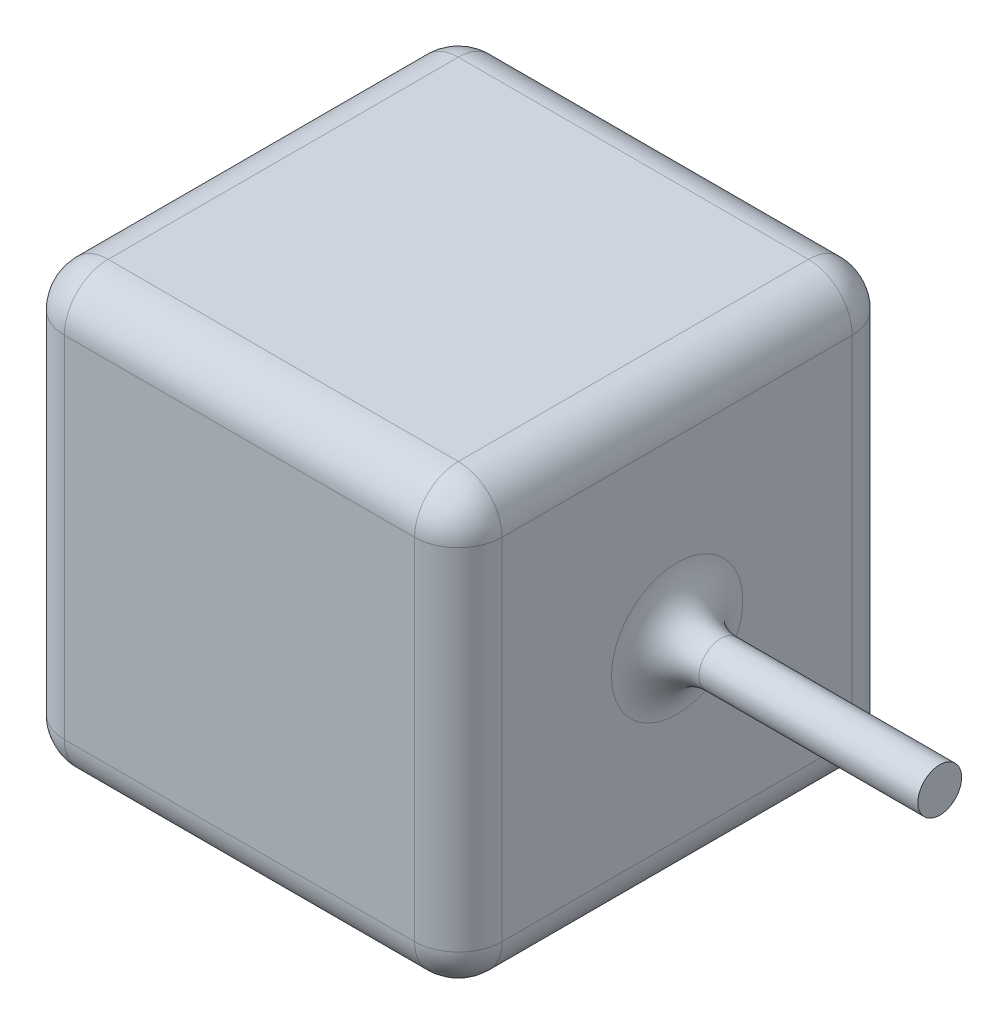
ISO-10303-21;
HEADER;
FILE_DESCRIPTION(('STEP AP214'),'2;1');
FILE_NAME('part.step','',(''),(''),'','','');
FILE_SCHEMA(('AUTOMOTIVE_DESIGN { 1 0 10303 214 1 1 1 1 }'));
ENDSEC;
DATA;
#1=APPLICATION_CONTEXT('core data for automotive mechanical design processes');
#2=APPLICATION_PROTOCOL_DEFINITION('international standard','automotive_design',2000,#1);
#3=PRODUCT_CONTEXT('',#1,'mechanical');
#4=PRODUCT('Part','Part','',(#3));
#5=PRODUCT_RELATED_PRODUCT_CATEGORY('part','',(#4));
#6=PRODUCT_DEFINITION_FORMATION('','',#4);
#7=PRODUCT_DEFINITION_CONTEXT('part definition',#1,'design');
#8=PRODUCT_DEFINITION('design','',#6,#7);
#9=PRODUCT_DEFINITION_SHAPE('','',#8);
#10=(LENGTH_UNIT() NAMED_UNIT(*) SI_UNIT(.MILLI.,.METRE.));
#11=(NAMED_UNIT(*) PLANE_ANGLE_UNIT() SI_UNIT($,.RADIAN.));
#12=(NAMED_UNIT(*) SI_UNIT($,.STERADIAN.) SOLID_ANGLE_UNIT());
#13=UNCERTAINTY_MEASURE_WITH_UNIT(LENGTH_MEASURE(1.E-05),#10,'distance_accuracy_value','');
#14=(GEOMETRIC_REPRESENTATION_CONTEXT(3) GLOBAL_UNCERTAINTY_ASSIGNED_CONTEXT((#13)) GLOBAL_UNIT_ASSIGNED_CONTEXT((#10,
#11,#12)) REPRESENTATION_CONTEXT('',''));
#15=CARTESIAN_POINT('',(0.,0.,0.));
#16=DIRECTION('',(0.,0.,1.));
#17=DIRECTION('',(1.,0.,0.));
#18=AXIS2_PLACEMENT_3D('',#15,#16,#17);
#19=CARTESIAN_POINT('',(0.,100.,0.));
#20=DIRECTION('',(1.,0.,0.));
#21=DIRECTION('',(0.,0.,-1.));
#22=AXIS2_PLACEMENT_3D('',#19,#20,#21);
#23=PLANE('',#22);
#24=DIRECTION('',(0.,0.,1.));
#25=VECTOR('',#24,1.);
#26=CARTESIAN_POINT('',(0.,90.,0.));
#27=LINE('',#26,#25);
#28=CARTESIAN_POINT('',(0.,90.,-10.));
#29=VERTEX_POINT('',#28);
#30=CARTESIAN_POINT('',(0.,90.,-90.));
#31=VERTEX_POINT('',#30);
#32=EDGE_CURVE('E127',#29,#31,#27,.F.);
#33=ORIENTED_EDGE('',*,*,#32,.T.);
#34=DIRECTION('',(0.,-1.,0.));
#35=VECTOR('',#34,1.);
#36=CARTESIAN_POINT('',(0.,100.,-90.));
#37=LINE('',#36,#35);
#38=CARTESIAN_POINT('',(0.,9.99999999999999,-90.));
#39=VERTEX_POINT('',#38);
#40=EDGE_CURVE('E165',#31,#39,#37,.T.);
#41=ORIENTED_EDGE('',*,*,#40,.T.);
#42=DIRECTION('',(0.,0.,1.));
#43=VECTOR('',#42,1.);
#44=CARTESIAN_POINT('',(0.,9.99999999999999,0.));
#45=LINE('',#44,#43);
#46=CARTESIAN_POINT('',(0.,9.99999999999999,-10.));
#47=VERTEX_POINT('',#46);
#48=EDGE_CURVE('E130',#39,#47,#45,.T.);
#49=ORIENTED_EDGE('',*,*,#48,.T.);
#50=DIRECTION('',(0.,-1.,0.));
#51=VECTOR('',#50,1.);
#52=CARTESIAN_POINT('',(0.,100.,-10.));
#53=LINE('',#52,#51);
#54=EDGE_CURVE('E123',#47,#29,#53,.F.);
#55=ORIENTED_EDGE('',*,*,#54,.T.);
#56=EDGE_LOOP('',(#33,#41,#49,#55));
#57=FACE_BOUND('',#56,.T.);
#58=ADVANCED_FACE('F35',(#57),#23,.F.);
#59=CARTESIAN_POINT('',(0.,100.,0.));
#60=DIRECTION('',(0.,0.,-1.));
#61=DIRECTION('',(-1.,0.,0.));
#62=AXIS2_PLACEMENT_3D('',#59,#60,#61);
#63=PLANE('',#62);
#64=DIRECTION('',(0.,-1.,0.));
#65=VECTOR('',#64,1.);
#66=CARTESIAN_POINT('',(10.,100.,0.));
#67=LINE('',#66,#65);
#68=CARTESIAN_POINT('',(10.,90.,0.));
#69=VERTEX_POINT('',#68);
#70=CARTESIAN_POINT('',(10.,9.99999999999999,0.));
#71=VERTEX_POINT('',#70);
#72=EDGE_CURVE('E141',#69,#71,#67,.T.);
#73=ORIENTED_EDGE('',*,*,#72,.T.);
#74=DIRECTION('',(1.,0.,0.));
#75=VECTOR('',#74,1.);
#76=CARTESIAN_POINT('',(100.,9.99999999999999,0.));
#77=LINE('',#76,#75);
#78=CARTESIAN_POINT('',(90.,9.99999999999999,0.));
#79=VERTEX_POINT('',#78);
#80=EDGE_CURVE('E205',#71,#79,#77,.T.);
#81=ORIENTED_EDGE('',*,*,#80,.T.);
#82=DIRECTION('',(0.,-1.,0.));
#83=VECTOR('',#82,1.);
#84=CARTESIAN_POINT('',(90.,100.,0.));
#85=LINE('',#84,#83);
#86=CARTESIAN_POINT('',(90.,90.,0.));
#87=VERTEX_POINT('',#86);
#88=EDGE_CURVE('E202',#79,#87,#85,.F.);
#89=ORIENTED_EDGE('',*,*,#88,.T.);
#90=DIRECTION('',(1.,0.,0.));
#91=VECTOR('',#90,1.);
#92=CARTESIAN_POINT('',(0.,90.,0.));
#93=LINE('',#92,#91);
#94=EDGE_CURVE('E200',#87,#69,#93,.F.);
#95=ORIENTED_EDGE('',*,*,#94,.T.);
#96=EDGE_LOOP('',(#73,#81,#89,#95));
#97=FACE_BOUND('',#96,.T.);
#98=ADVANCED_FACE('F288',(#97),#63,.F.);
#99=CARTESIAN_POINT('',(100.,100.,0.));
#100=DIRECTION('',(-1.,0.,0.));
#101=DIRECTION('',(0.,0.,1.));
#102=AXIS2_PLACEMENT_3D('',#99,#100,#101);
#103=PLANE('',#102);
#104=CARTESIAN_POINT('',(100.,50.,-50.));
#105=DIRECTION('',(-1.,0.,0.));
#106=DIRECTION('',(0.,0.,1.));
#107=AXIS2_PLACEMENT_3D('',#104,#105,#106);
#108=CIRCLE('',#107,15.);
#109=CARTESIAN_POINT('',(100.,50.,-35.));
#110=VERTEX_POINT('',#109);
#111=EDGE_CURVE('E194',#110,#110,#108,.T.);
#112=ORIENTED_EDGE('',*,*,#111,.T.);
#113=EDGE_LOOP('',(#112));
#114=FACE_BOUND('',#113,.T.);
#115=DIRECTION('',(0.,0.,-1.));
#116=VECTOR('',#115,1.);
#117=CARTESIAN_POINT('',(100.,9.99999999999999,-100.));
#118=LINE('',#117,#116);
#119=CARTESIAN_POINT('',(100.,9.99999999999999,-10.));
#120=VERTEX_POINT('',#119);
#121=CARTESIAN_POINT('',(100.,9.99999999999999,-90.));
#122=VERTEX_POINT('',#121);
#123=EDGE_CURVE('E189',#120,#122,#118,.T.);
#124=ORIENTED_EDGE('',*,*,#123,.T.);
#125=DIRECTION('',(0.,-1.,0.));
#126=VECTOR('',#125,1.);
#127=CARTESIAN_POINT('',(100.,100.,-90.));
#128=LINE('',#127,#126);
#129=CARTESIAN_POINT('',(100.,90.,-90.));
#130=VERTEX_POINT('',#129);
#131=EDGE_CURVE('E191',#122,#130,#128,.F.);
#132=ORIENTED_EDGE('',*,*,#131,.T.);
#133=DIRECTION('',(0.,0.,-1.));
#134=VECTOR('',#133,1.);
#135=CARTESIAN_POINT('',(100.,90.,0.));
#136=LINE('',#135,#134);
#137=CARTESIAN_POINT('',(100.,90.,-10.));
#138=VERTEX_POINT('',#137);
#139=EDGE_CURVE('E185',#130,#138,#136,.F.);
#140=ORIENTED_EDGE('',*,*,#139,.T.);
#141=DIRECTION('',(0.,-1.,0.));
#142=VECTOR('',#141,1.);
#143=CARTESIAN_POINT('',(100.,100.,-10.));
#144=LINE('',#143,#142);
#145=EDGE_CURVE('E187',#138,#120,#144,.T.);
#146=ORIENTED_EDGE('',*,*,#145,.T.);
#147=EDGE_LOOP('',(#124,#132,#140,#146));
#148=FACE_BOUND('',#147,.T.);
#149=ADVANCED_FACE('F300',(#114,#148),#103,.F.);
#150=CARTESIAN_POINT('',(0.,100.,-100.));
#151=DIRECTION('',(0.,0.,1.));
#152=DIRECTION('',(1.,0.,0.));
#153=AXIS2_PLACEMENT_3D('',#150,#151,#152);
#154=PLANE('',#153);
#155=DIRECTION('',(-1.,0.,0.));
#156=VECTOR('',#155,1.);
#157=CARTESIAN_POINT('',(0.,9.99999999999999,-100.));
#158=LINE('',#157,#156);
#159=CARTESIAN_POINT('',(90.,9.99999999999999,-100.));
#160=VERTEX_POINT('',#159);
#161=CARTESIAN_POINT('',(10.,9.99999999999999,-100.));
#162=VERTEX_POINT('',#161);
#163=EDGE_CURVE('E171',#160,#162,#158,.T.);
#164=ORIENTED_EDGE('',*,*,#163,.T.);
#165=DIRECTION('',(0.,-1.,0.));
#166=VECTOR('',#165,1.);
#167=CARTESIAN_POINT('',(10.,100.,-100.));
#168=LINE('',#167,#166);
#169=CARTESIAN_POINT('',(10.,90.,-100.));
#170=VERTEX_POINT('',#169);
#171=EDGE_CURVE('E173',#162,#170,#168,.F.);
#172=ORIENTED_EDGE('',*,*,#171,.T.);
#173=DIRECTION('',(-1.,0.,0.));
#174=VECTOR('',#173,1.);
#175=CARTESIAN_POINT('',(0.,90.,-100.));
#176=LINE('',#175,#174);
#177=CARTESIAN_POINT('',(90.,90.,-100.));
#178=VERTEX_POINT('',#177);
#179=EDGE_CURVE('E167',#170,#178,#176,.F.);
#180=ORIENTED_EDGE('',*,*,#179,.T.);
#181=DIRECTION('',(0.,-1.,0.));
#182=VECTOR('',#181,1.);
#183=CARTESIAN_POINT('',(90.,100.,-100.));
#184=LINE('',#183,#182);
#185=EDGE_CURVE('E169',#178,#160,#184,.T.);
#186=ORIENTED_EDGE('',*,*,#185,.T.);
#187=EDGE_LOOP('',(#164,#172,#180,#186));
#188=FACE_BOUND('',#187,.T.);
#189=ADVANCED_FACE('F307',(#188),#154,.F.);
#190=CARTESIAN_POINT('',(0.,100.,0.));
#191=DIRECTION('',(0.,-1.,0.));
#192=DIRECTION('',(0.,0.,-1.));
#193=AXIS2_PLACEMENT_3D('',#190,#191,#192);
#194=PLANE('',#193);
#195=DIRECTION('',(0.,0.,-1.));
#196=VECTOR('',#195,1.);
#197=CARTESIAN_POINT('',(90.,100.,0.));
#198=LINE('',#197,#196);
#199=CARTESIAN_POINT('',(90.,100.,-10.));
#200=VERTEX_POINT('',#199);
#201=CARTESIAN_POINT('',(90.,100.,-90.));
#202=VERTEX_POINT('',#201);
#203=EDGE_CURVE('E44',#200,#202,#198,.T.);
#204=ORIENTED_EDGE('',*,*,#203,.T.);
#205=DIRECTION('',(-1.,0.,0.));
#206=VECTOR('',#205,1.);
#207=CARTESIAN_POINT('',(0.,100.,-90.));
#208=LINE('',#207,#206);
#209=CARTESIAN_POINT('',(10.,100.,-90.));
#210=VERTEX_POINT('',#209);
#211=EDGE_CURVE('E11',#202,#210,#208,.T.);
#212=ORIENTED_EDGE('',*,*,#211,.T.);
#213=DIRECTION('',(0.,0.,1.));
#214=VECTOR('',#213,1.);
#215=CARTESIAN_POINT('',(10.,100.,0.));
#216=LINE('',#215,#214);
#217=CARTESIAN_POINT('',(10.,100.,-10.));
#218=VERTEX_POINT('',#217);
#219=EDGE_CURVE('E207',#210,#218,#216,.T.);
#220=ORIENTED_EDGE('',*,*,#219,.T.);
#221=DIRECTION('',(1.,0.,0.));
#222=VECTOR('',#221,1.);
#223=CARTESIAN_POINT('',(0.,100.,-10.));
#224=LINE('',#223,#222);
#225=EDGE_CURVE('E55',#218,#200,#224,.T.);
#226=ORIENTED_EDGE('',*,*,#225,.T.);
#227=EDGE_LOOP('',(#204,#212,#220,#226));
#228=FACE_BOUND('',#227,.T.);
#229=ADVANCED_FACE('F284',(#228),#194,.F.);
#230=CARTESIAN_POINT('',(0.,0.,0.));
#231=DIRECTION('',(0.,-1.,0.));
#232=DIRECTION('',(0.,0.,-1.));
#233=AXIS2_PLACEMENT_3D('',#230,#231,#232);
#234=PLANE('',#233);
#235=DIRECTION('',(0.,0.,1.));
#236=VECTOR('',#235,1.);
#237=CARTESIAN_POINT('',(10.,0.,-100.));
#238=LINE('',#237,#236);
#239=CARTESIAN_POINT('',(10.,0.,-10.));
#240=VERTEX_POINT('',#239);
#241=CARTESIAN_POINT('',(10.,0.,-90.));
#242=VERTEX_POINT('',#241);
#243=EDGE_CURVE('E180',#240,#242,#238,.F.);
#244=ORIENTED_EDGE('',*,*,#243,.T.);
#245=DIRECTION('',(-1.,0.,0.));
#246=VECTOR('',#245,1.);
#247=CARTESIAN_POINT('',(100.,0.,-90.));
#248=LINE('',#247,#246);
#249=CARTESIAN_POINT('',(90.,0.,-90.));
#250=VERTEX_POINT('',#249);
#251=EDGE_CURVE('E182',#242,#250,#248,.F.);
#252=ORIENTED_EDGE('',*,*,#251,.T.);
#253=DIRECTION('',(0.,0.,-1.));
#254=VECTOR('',#253,1.);
#255=CARTESIAN_POINT('',(90.,0.,0.));
#256=LINE('',#255,#254);
#257=CARTESIAN_POINT('',(90.,0.,-10.));
#258=VERTEX_POINT('',#257);
#259=EDGE_CURVE('E178',#250,#258,#256,.F.);
#260=ORIENTED_EDGE('',*,*,#259,.T.);
#261=DIRECTION('',(1.,0.,0.));
#262=VECTOR('',#261,1.);
#263=CARTESIAN_POINT('',(0.,0.,-10.));
#264=LINE('',#263,#262);
#265=EDGE_CURVE('E176',#258,#240,#264,.F.);
#266=ORIENTED_EDGE('',*,*,#265,.T.);
#267=EDGE_LOOP('',(#244,#252,#260,#266));
#268=FACE_BOUND('',#267,.T.);
#269=ADVANCED_FACE('F328',(#268),#234,.T.);
#270=CARTESIAN_POINT('',(160.,50.,-50.));
#271=DIRECTION('',(-1.,0.,0.));
#272=DIRECTION('',(0.,0.,1.));
#273=AXIS2_PLACEMENT_3D('',#270,#271,#272);
#274=CYLINDRICAL_SURFACE('',#273,5.00000000000001);
#275=CARTESIAN_POINT('',(110.,50.,-50.));
#276=DIRECTION('',(-1.,0.,0.));
#277=DIRECTION('',(0.,0.,1.));
#278=AXIS2_PLACEMENT_3D('',#275,#276,#277);
#279=CIRCLE('',#278,5.00000000000001);
#280=CARTESIAN_POINT('',(110.,50.,-45.));
#281=VERTEX_POINT('',#280);
#282=EDGE_CURVE('E197',#281,#281,#279,.F.);
#283=ORIENTED_EDGE('',*,*,#282,.T.);
#284=EDGE_LOOP('',(#283));
#285=FACE_BOUND('',#284,.T.);
#286=CARTESIAN_POINT('',(160.,50.,-50.));
#287=DIRECTION('',(1.,0.,0.));
#288=DIRECTION('',(0.,0.,-1.));
#289=AXIS2_PLACEMENT_3D('',#286,#287,#288);
#290=CIRCLE('',#289,5.00000000000001);
#291=CARTESIAN_POINT('',(160.,50.,-55.));
#292=VERTEX_POINT('',#291);
#293=EDGE_CURVE('E159',#292,#292,#290,.T.);
#294=ORIENTED_EDGE('',*,*,#293,.F.);
#295=EDGE_LOOP('',(#294));
#296=FACE_BOUND('',#295,.T.);
#297=ADVANCED_FACE('F506',(#285,#296),#274,.T.);
#298=CARTESIAN_POINT('',(160.,50.,-50.));
#299=DIRECTION('',(1.,0.,0.));
#300=DIRECTION('',(0.,0.,-1.));
#301=AXIS2_PLACEMENT_3D('',#298,#299,#300);
#302=PLANE('',#301);
#303=ORIENTED_EDGE('',*,*,#293,.T.);
#304=EDGE_LOOP('',(#303));
#305=FACE_BOUND('',#304,.T.);
#306=ADVANCED_FACE('F498',(#305),#302,.T.);
#307=CARTESIAN_POINT('',(90.,100.,-10.));
#308=DIRECTION('',(0.,-1.,0.));
#309=DIRECTION('',(0.,0.,-1.));
#310=AXIS2_PLACEMENT_3D('',#307,#308,#309);
#311=CYLINDRICAL_SURFACE('',#310,10.);
#312=CARTESIAN_POINT('',(90.,90.,-10.));
#313=DIRECTION('',(0.,1.,0.));
#314=DIRECTION('',(0.,0.,1.));
#315=AXIS2_PLACEMENT_3D('',#312,#313,#314);
#316=CIRCLE('',#315,10.);
#317=EDGE_CURVE('E39',#87,#138,#316,.T.);
#318=ORIENTED_EDGE('',*,*,#317,.F.);
#319=ORIENTED_EDGE('',*,*,#88,.F.);
#320=CARTESIAN_POINT('',(90.,9.99999999999999,-10.));
#321=DIRECTION('',(0.,-1.,0.));
#322=DIRECTION('',(0.,0.,-1.));
#323=AXIS2_PLACEMENT_3D('',#320,#321,#322);
#324=CIRCLE('',#323,10.);
#325=EDGE_CURVE('E256',#120,#79,#324,.T.);
#326=ORIENTED_EDGE('',*,*,#325,.F.);
#327=ORIENTED_EDGE('',*,*,#145,.F.);
#328=EDGE_LOOP('',(#318,#319,#326,#327));
#329=FACE_BOUND('',#328,.T.);
#330=ADVANCED_FACE('F290',(#329),#311,.T.);
#331=CARTESIAN_POINT('',(90.,90.,-10.));
#332=DIRECTION('',(0.,0.,1.));
#333=DIRECTION('',(1.,0.,0.));
#334=AXIS2_PLACEMENT_3D('',#331,#332,#333);
#335=SPHERICAL_SURFACE('',#334,10.);
#336=CARTESIAN_POINT('',(90.,90.,-10.));
#337=DIRECTION('',(1.,0.,0.));
#338=DIRECTION('',(0.,0.,-1.));
#339=AXIS2_PLACEMENT_3D('',#336,#337,#338);
#340=CIRCLE('',#339,10.);
#341=EDGE_CURVE('E252',#87,#200,#340,.F.);
#342=ORIENTED_EDGE('',*,*,#341,.F.);
#343=ORIENTED_EDGE('',*,*,#317,.T.);
#344=CARTESIAN_POINT('',(90.,90.,-10.));
#345=DIRECTION('',(0.,0.,1.));
#346=DIRECTION('',(1.,0.,0.));
#347=AXIS2_PLACEMENT_3D('',#344,#345,#346);
#348=CIRCLE('',#347,10.);
#349=EDGE_CURVE('E254',#200,#138,#348,.F.);
#350=ORIENTED_EDGE('',*,*,#349,.F.);
#351=EDGE_LOOP('',(#342,#343,#350));
#352=FACE_BOUND('',#351,.T.);
#353=ADVANCED_FACE('F267',(#352),#335,.T.);
#354=CARTESIAN_POINT('',(90.,10.,-10.));
#355=DIRECTION('',(0.,0.,1.));
#356=DIRECTION('',(1.,0.,0.));
#357=AXIS2_PLACEMENT_3D('',#354,#355,#356);
#358=SPHERICAL_SURFACE('',#357,10.);
#359=CARTESIAN_POINT('',(90.,10.,-10.));
#360=DIRECTION('',(0.,0.,1.));
#361=DIRECTION('',(1.,0.,0.));
#362=AXIS2_PLACEMENT_3D('',#359,#360,#361);
#363=CIRCLE('',#362,10.);
#364=EDGE_CURVE('E246',#120,#258,#363,.F.);
#365=ORIENTED_EDGE('',*,*,#364,.F.);
#366=ORIENTED_EDGE('',*,*,#325,.T.);
#367=CARTESIAN_POINT('',(90.,9.99999999999999,-10.));
#368=DIRECTION('',(1.,0.,0.));
#369=DIRECTION('',(0.,0.,-1.));
#370=AXIS2_PLACEMENT_3D('',#367,#368,#369);
#371=CIRCLE('',#370,10.);
#372=EDGE_CURVE('E249',#258,#79,#371,.F.);
#373=ORIENTED_EDGE('',*,*,#372,.F.);
#374=EDGE_LOOP('',(#365,#366,#373));
#375=FACE_BOUND('',#374,.T.);
#376=ADVANCED_FACE('F292',(#375),#358,.T.);
#377=CARTESIAN_POINT('',(90.,90.,0.));
#378=DIRECTION('',(0.,0.,-1.));
#379=DIRECTION('',(-1.,0.,0.));
#380=AXIS2_PLACEMENT_3D('',#377,#378,#379);
#381=CYLINDRICAL_SURFACE('',#380,10.);
#382=ORIENTED_EDGE('',*,*,#349,.T.);
#383=ORIENTED_EDGE('',*,*,#139,.F.);
#384=CARTESIAN_POINT('',(90.,90.,-90.));
#385=DIRECTION('',(0.,0.,-1.));
#386=DIRECTION('',(-1.,0.,0.));
#387=AXIS2_PLACEMENT_3D('',#384,#385,#386);
#388=CIRCLE('',#387,10.);
#389=EDGE_CURVE('E241',#202,#130,#388,.T.);
#390=ORIENTED_EDGE('',*,*,#389,.F.);
#391=ORIENTED_EDGE('',*,*,#203,.F.);
#392=EDGE_LOOP('',(#382,#383,#390,#391));
#393=FACE_BOUND('',#392,.T.);
#394=ADVANCED_FACE('F274',(#393),#381,.T.);
#395=CARTESIAN_POINT('',(0.,90.,-10.));
#396=DIRECTION('',(1.,0.,0.));
#397=DIRECTION('',(0.,0.,-1.));
#398=AXIS2_PLACEMENT_3D('',#395,#396,#397);
#399=CYLINDRICAL_SURFACE('',#398,10.);
#400=ORIENTED_EDGE('',*,*,#341,.T.);
#401=ORIENTED_EDGE('',*,*,#225,.F.);
#402=CARTESIAN_POINT('',(10.,90.,-10.));
#403=DIRECTION('',(-1.,0.,0.));
#404=DIRECTION('',(0.,0.,1.));
#405=AXIS2_PLACEMENT_3D('',#402,#403,#404);
#406=CIRCLE('',#405,10.);
#407=EDGE_CURVE('E145',#69,#218,#406,.T.);
#408=ORIENTED_EDGE('',*,*,#407,.F.);
#409=ORIENTED_EDGE('',*,*,#94,.F.);
#410=EDGE_LOOP('',(#400,#401,#408,#409));
#411=FACE_BOUND('',#410,.T.);
#412=ADVANCED_FACE('F286',(#411),#399,.T.);
#413=CARTESIAN_POINT('',(10.,100.,-10.));
#414=DIRECTION('',(0.,-1.,0.));
#415=DIRECTION('',(0.,0.,-1.));
#416=AXIS2_PLACEMENT_3D('',#413,#414,#415);
#417=CYLINDRICAL_SURFACE('',#416,10.);
#418=CARTESIAN_POINT('',(10.,9.99999999999999,-10.));
#419=DIRECTION('',(0.,-1.,0.));
#420=DIRECTION('',(0.,0.,-1.));
#421=AXIS2_PLACEMENT_3D('',#418,#419,#420);
#422=CIRCLE('',#421,10.);
#423=EDGE_CURVE('E146',#71,#47,#422,.T.);
#424=ORIENTED_EDGE('',*,*,#423,.F.);
#425=ORIENTED_EDGE('',*,*,#72,.F.);
#426=CARTESIAN_POINT('',(10.,90.,-10.));
#427=DIRECTION('',(0.,1.,0.));
#428=DIRECTION('',(0.,0.,1.));
#429=AXIS2_PLACEMENT_3D('',#426,#427,#428);
#430=CIRCLE('',#429,10.);
#431=EDGE_CURVE('E137',#29,#69,#430,.T.);
#432=ORIENTED_EDGE('',*,*,#431,.F.);
#433=ORIENTED_EDGE('',*,*,#54,.F.);
#434=EDGE_LOOP('',(#424,#425,#432,#433));
#435=FACE_BOUND('',#434,.T.);
#436=ADVANCED_FACE('F139',(#435),#417,.T.);
#437=CARTESIAN_POINT('',(0.,9.99999999999999,-10.));
#438=DIRECTION('',(-1.,0.,0.));
#439=DIRECTION('',(0.,0.,1.));
#440=AXIS2_PLACEMENT_3D('',#437,#438,#439);
#441=CYLINDRICAL_SURFACE('',#440,10.);
#442=ORIENTED_EDGE('',*,*,#372,.T.);
#443=ORIENTED_EDGE('',*,*,#80,.F.);
#444=CARTESIAN_POINT('',(10.,10.,-10.));
#445=DIRECTION('',(-1.,0.,0.));
#446=DIRECTION('',(0.,0.,1.));
#447=AXIS2_PLACEMENT_3D('',#444,#445,#446);
#448=CIRCLE('',#447,10.);
#449=EDGE_CURVE('E237',#240,#71,#448,.T.);
#450=ORIENTED_EDGE('',*,*,#449,.F.);
#451=ORIENTED_EDGE('',*,*,#265,.F.);
#452=EDGE_LOOP('',(#442,#443,#450,#451));
#453=FACE_BOUND('',#452,.T.);
#454=ADVANCED_FACE('F326',(#453),#441,.T.);
#455=CARTESIAN_POINT('',(90.,9.99999999999999,0.));
#456=DIRECTION('',(0.,0.,1.));
#457=DIRECTION('',(1.,0.,0.));
#458=AXIS2_PLACEMENT_3D('',#455,#456,#457);
#459=CYLINDRICAL_SURFACE('',#458,10.);
#460=ORIENTED_EDGE('',*,*,#364,.T.);
#461=ORIENTED_EDGE('',*,*,#259,.F.);
#462=CARTESIAN_POINT('',(90.,9.99999999999999,-90.));
#463=DIRECTION('',(0.,0.,-1.));
#464=DIRECTION('',(-1.,0.,0.));
#465=AXIS2_PLACEMENT_3D('',#462,#463,#464);
#466=CIRCLE('',#465,10.);
#467=EDGE_CURVE('E234',#122,#250,#466,.T.);
#468=ORIENTED_EDGE('',*,*,#467,.F.);
#469=ORIENTED_EDGE('',*,*,#123,.F.);
#470=EDGE_LOOP('',(#460,#461,#468,#469));
#471=FACE_BOUND('',#470,.T.);
#472=ADVANCED_FACE('F297',(#471),#459,.T.);
#473=CARTESIAN_POINT('',(90.,100.,-90.));
#474=DIRECTION('',(0.,-1.,0.));
#475=DIRECTION('',(0.,0.,-1.));
#476=AXIS2_PLACEMENT_3D('',#473,#474,#475);
#477=CYLINDRICAL_SURFACE('',#476,10.);
#478=CARTESIAN_POINT('',(90.,90.,-90.));
#479=DIRECTION('',(0.,1.,0.));
#480=DIRECTION('',(0.,0.,1.));
#481=AXIS2_PLACEMENT_3D('',#478,#479,#480);
#482=CIRCLE('',#481,10.);
#483=EDGE_CURVE('E243',#130,#178,#482,.T.);
#484=ORIENTED_EDGE('',*,*,#483,.F.);
#485=ORIENTED_EDGE('',*,*,#131,.F.);
#486=CARTESIAN_POINT('',(90.,9.99999999999999,-90.));
#487=DIRECTION('',(0.,-1.,0.));
#488=DIRECTION('',(0.,0.,-1.));
#489=AXIS2_PLACEMENT_3D('',#486,#487,#488);
#490=CIRCLE('',#489,10.);
#491=EDGE_CURVE('E231',#160,#122,#490,.T.);
#492=ORIENTED_EDGE('',*,*,#491,.F.);
#493=ORIENTED_EDGE('',*,*,#185,.F.);
#494=EDGE_LOOP('',(#484,#485,#492,#493));
#495=FACE_BOUND('',#494,.T.);
#496=ADVANCED_FACE('F303',(#495),#477,.T.);
#497=CARTESIAN_POINT('',(90.,90.,-90.));
#498=DIRECTION('',(0.,0.,1.));
#499=DIRECTION('',(1.,0.,0.));
#500=AXIS2_PLACEMENT_3D('',#497,#498,#499);
#501=SPHERICAL_SURFACE('',#500,10.);
#502=ORIENTED_EDGE('',*,*,#389,.T.);
#503=ORIENTED_EDGE('',*,*,#483,.T.);
#504=CARTESIAN_POINT('',(90.,90.,-90.));
#505=DIRECTION('',(1.,0.,0.));
#506=DIRECTION('',(0.,0.,-1.));
#507=AXIS2_PLACEMENT_3D('',#504,#505,#506);
#508=CIRCLE('',#507,10.);
#509=EDGE_CURVE('E153',#202,#178,#508,.F.);
#510=ORIENTED_EDGE('',*,*,#509,.F.);
#511=EDGE_LOOP('',(#502,#503,#510));
#512=FACE_BOUND('',#511,.T.);
#513=ADVANCED_FACE('F279',(#512),#501,.T.);
#514=CARTESIAN_POINT('',(10.,90.,-10.));
#515=DIRECTION('',(0.,0.,1.));
#516=DIRECTION('',(1.,0.,0.));
#517=AXIS2_PLACEMENT_3D('',#514,#515,#516);
#518=SPHERICAL_SURFACE('',#517,10.);
#519=ORIENTED_EDGE('',*,*,#431,.T.);
#520=ORIENTED_EDGE('',*,*,#407,.T.);
#521=CARTESIAN_POINT('',(10.,90.,-10.));
#522=DIRECTION('',(0.,0.,1.));
#523=DIRECTION('',(1.,0.,0.));
#524=AXIS2_PLACEMENT_3D('',#521,#522,#523);
#525=CIRCLE('',#524,10.);
#526=EDGE_CURVE('E149',#29,#218,#525,.F.);
#527=ORIENTED_EDGE('',*,*,#526,.F.);
#528=EDGE_LOOP('',(#519,#520,#527));
#529=FACE_BOUND('',#528,.T.);
#530=ADVANCED_FACE('F150',(#529),#518,.T.);
#531=CARTESIAN_POINT('',(10.,10.,-10.));
#532=DIRECTION('',(0.,0.,1.));
#533=DIRECTION('',(1.,0.,0.));
#534=AXIS2_PLACEMENT_3D('',#531,#532,#533);
#535=SPHERICAL_SURFACE('',#534,10.);
#536=ORIENTED_EDGE('',*,*,#449,.T.);
#537=ORIENTED_EDGE('',*,*,#423,.T.);
#538=CARTESIAN_POINT('',(10.,9.99999999999999,-10.));
#539=DIRECTION('',(0.,0.,1.));
#540=DIRECTION('',(1.,0.,0.));
#541=AXIS2_PLACEMENT_3D('',#538,#539,#540);
#542=CIRCLE('',#541,10.);
#543=EDGE_CURVE('E154',#240,#47,#542,.F.);
#544=ORIENTED_EDGE('',*,*,#543,.F.);
#545=EDGE_LOOP('',(#536,#537,#544));
#546=FACE_BOUND('',#545,.T.);
#547=ADVANCED_FACE('F323',(#546),#535,.T.);
#548=CARTESIAN_POINT('',(90.,10.,-90.));
#549=DIRECTION('',(0.,0.,1.));
#550=DIRECTION('',(1.,0.,0.));
#551=AXIS2_PLACEMENT_3D('',#548,#549,#550);
#552=SPHERICAL_SURFACE('',#551,10.);
#553=ORIENTED_EDGE('',*,*,#491,.T.);
#554=ORIENTED_EDGE('',*,*,#467,.T.);
#555=CARTESIAN_POINT('',(90.,10.,-90.));
#556=DIRECTION('',(1.,0.,0.));
#557=DIRECTION('',(0.,0.,-1.));
#558=AXIS2_PLACEMENT_3D('',#555,#556,#557);
#559=CIRCLE('',#558,10.);
#560=EDGE_CURVE('E225',#160,#250,#559,.F.);
#561=ORIENTED_EDGE('',*,*,#560,.F.);
#562=EDGE_LOOP('',(#553,#554,#561));
#563=FACE_BOUND('',#562,.T.);
#564=ADVANCED_FACE('F333',(#563),#552,.T.);
#565=CARTESIAN_POINT('',(0.,90.,-90.));
#566=DIRECTION('',(-1.,0.,0.));
#567=DIRECTION('',(0.,0.,1.));
#568=AXIS2_PLACEMENT_3D('',#565,#566,#567);
#569=CYLINDRICAL_SURFACE('',#568,10.);
#570=ORIENTED_EDGE('',*,*,#509,.T.);
#571=ORIENTED_EDGE('',*,*,#179,.F.);
#572=CARTESIAN_POINT('',(10.,90.,-90.));
#573=DIRECTION('',(-1.,0.,0.));
#574=DIRECTION('',(0.,0.,1.));
#575=AXIS2_PLACEMENT_3D('',#572,#573,#574);
#576=CIRCLE('',#575,10.);
#577=EDGE_CURVE('E222',#210,#170,#576,.T.);
#578=ORIENTED_EDGE('',*,*,#577,.F.);
#579=ORIENTED_EDGE('',*,*,#211,.F.);
#580=EDGE_LOOP('',(#570,#571,#578,#579));
#581=FACE_BOUND('',#580,.T.);
#582=ADVANCED_FACE('F283',(#581),#569,.T.);
#583=CARTESIAN_POINT('',(10.,90.,0.));
#584=DIRECTION('',(0.,0.,1.));
#585=DIRECTION('',(1.,0.,0.));
#586=AXIS2_PLACEMENT_3D('',#583,#584,#585);
#587=CYLINDRICAL_SURFACE('',#586,10.);
#588=ORIENTED_EDGE('',*,*,#526,.T.);
#589=ORIENTED_EDGE('',*,*,#219,.F.);
#590=CARTESIAN_POINT('',(10.,90.,-90.));
#591=DIRECTION('',(0.,0.,-1.));
#592=DIRECTION('',(-1.,0.,0.));
#593=AXIS2_PLACEMENT_3D('',#590,#591,#592);
#594=CIRCLE('',#593,10.);
#595=EDGE_CURVE('E157',#31,#210,#594,.T.);
#596=ORIENTED_EDGE('',*,*,#595,.F.);
#597=ORIENTED_EDGE('',*,*,#32,.F.);
#598=EDGE_LOOP('',(#588,#589,#596,#597));
#599=FACE_BOUND('',#598,.T.);
#600=ADVANCED_FACE('F156',(#599),#587,.T.);
#601=CARTESIAN_POINT('',(10.,9.99999999999999,0.));
#602=DIRECTION('',(0.,0.,-1.));
#603=DIRECTION('',(-1.,0.,0.));
#604=AXIS2_PLACEMENT_3D('',#601,#602,#603);
#605=CYLINDRICAL_SURFACE('',#604,10.);
#606=ORIENTED_EDGE('',*,*,#543,.T.);
#607=ORIENTED_EDGE('',*,*,#48,.F.);
#608=CARTESIAN_POINT('',(10.,10.,-90.));
#609=DIRECTION('',(0.,0.,-1.));
#610=DIRECTION('',(-1.,0.,0.));
#611=AXIS2_PLACEMENT_3D('',#608,#609,#610);
#612=CIRCLE('',#611,10.);
#613=EDGE_CURVE('E218',#242,#39,#612,.T.);
#614=ORIENTED_EDGE('',*,*,#613,.F.);
#615=ORIENTED_EDGE('',*,*,#243,.F.);
#616=EDGE_LOOP('',(#606,#607,#614,#615));
#617=FACE_BOUND('',#616,.T.);
#618=ADVANCED_FACE('F320',(#617),#605,.T.);
#619=CARTESIAN_POINT('',(0.,9.99999999999999,-90.));
#620=DIRECTION('',(1.,0.,0.));
#621=DIRECTION('',(0.,0.,-1.));
#622=AXIS2_PLACEMENT_3D('',#619,#620,#621);
#623=CYLINDRICAL_SURFACE('',#622,10.);
#624=ORIENTED_EDGE('',*,*,#560,.T.);
#625=ORIENTED_EDGE('',*,*,#251,.F.);
#626=CARTESIAN_POINT('',(10.,9.99999999999999,-90.));
#627=DIRECTION('',(-1.,0.,0.));
#628=DIRECTION('',(0.,0.,1.));
#629=AXIS2_PLACEMENT_3D('',#626,#627,#628);
#630=CIRCLE('',#629,10.);
#631=EDGE_CURVE('E215',#162,#242,#630,.T.);
#632=ORIENTED_EDGE('',*,*,#631,.F.);
#633=ORIENTED_EDGE('',*,*,#163,.F.);
#634=EDGE_LOOP('',(#624,#625,#632,#633));
#635=FACE_BOUND('',#634,.T.);
#636=ADVANCED_FACE('F331',(#635),#623,.T.);
#637=CARTESIAN_POINT('',(10.,90.,-90.));
#638=DIRECTION('',(0.,0.,1.));
#639=DIRECTION('',(1.,0.,0.));
#640=AXIS2_PLACEMENT_3D('',#637,#638,#639);
#641=SPHERICAL_SURFACE('',#640,10.);
#642=ORIENTED_EDGE('',*,*,#595,.T.);
#643=ORIENTED_EDGE('',*,*,#577,.T.);
#644=CARTESIAN_POINT('',(10.,90.,-90.));
#645=DIRECTION('',(0.,1.,0.));
#646=DIRECTION('',(0.,0.,1.));
#647=AXIS2_PLACEMENT_3D('',#644,#645,#646);
#648=CIRCLE('',#647,10.);
#649=EDGE_CURVE('E213',#31,#170,#648,.F.);
#650=ORIENTED_EDGE('',*,*,#649,.F.);
#651=EDGE_LOOP('',(#642,#643,#650));
#652=FACE_BOUND('',#651,.T.);
#653=ADVANCED_FACE('F354',(#652),#641,.T.);
#654=CARTESIAN_POINT('',(10.,10.,-90.));
#655=DIRECTION('',(0.,0.,1.));
#656=DIRECTION('',(1.,0.,0.));
#657=AXIS2_PLACEMENT_3D('',#654,#655,#656);
#658=SPHERICAL_SURFACE('',#657,10.);
#659=ORIENTED_EDGE('',*,*,#631,.T.);
#660=ORIENTED_EDGE('',*,*,#613,.T.);
#661=CARTESIAN_POINT('',(10.,9.99999999999999,-90.));
#662=DIRECTION('',(0.,-1.,0.));
#663=DIRECTION('',(0.,0.,-1.));
#664=AXIS2_PLACEMENT_3D('',#661,#662,#663);
#665=CIRCLE('',#664,10.);
#666=EDGE_CURVE('E211',#162,#39,#665,.F.);
#667=ORIENTED_EDGE('',*,*,#666,.F.);
#668=EDGE_LOOP('',(#659,#660,#667));
#669=FACE_BOUND('',#668,.T.);
#670=ADVANCED_FACE('F316',(#669),#658,.T.);
#671=CARTESIAN_POINT('',(10.,100.,-90.));
#672=DIRECTION('',(0.,-1.,0.));
#673=DIRECTION('',(0.,0.,-1.));
#674=AXIS2_PLACEMENT_3D('',#671,#672,#673);
#675=CYLINDRICAL_SURFACE('',#674,10.);
#676=ORIENTED_EDGE('',*,*,#649,.T.);
#677=ORIENTED_EDGE('',*,*,#171,.F.);
#678=ORIENTED_EDGE('',*,*,#666,.T.);
#679=ORIENTED_EDGE('',*,*,#40,.F.);
#680=EDGE_LOOP('',(#676,#677,#678,#679));
#681=FACE_BOUND('',#680,.T.);
#682=ADVANCED_FACE('F313',(#681),#675,.T.);
#683=CARTESIAN_POINT('',(110.,50.,-50.));
#684=DIRECTION('',(-1.,0.,0.));
#685=DIRECTION('',(0.,0.,1.));
#686=AXIS2_PLACEMENT_3D('',#683,#684,#685);
#687=TOROIDAL_SURFACE('',#686,15.,10.);
#688=ORIENTED_EDGE('',*,*,#111,.F.);
#689=EDGE_LOOP('',(#688));
#690=FACE_BOUND('',#689,.T.);
#691=ORIENTED_EDGE('',*,*,#282,.F.);
#692=EDGE_LOOP('',(#691));
#693=FACE_BOUND('',#692,.T.);
#694=ADVANCED_FACE('F37',(#690,#693),#687,.F.);
#695=CLOSED_SHELL('',(#58,#98,#149,#189,#229,#269,#297,#306,#330,#353,#376,#394,#412,#436,#454,
#472,#496,#513,#530,#547,#564,#582,#600,#618,#636,#653,#670,#682,#694));
#696=MANIFOLD_SOLID_BREP('B2',#695);
#697=ADVANCED_BREP_SHAPE_REPRESENTATION('',(#18,#696),#14);
#698=SHAPE_DEFINITION_REPRESENTATION(#9,#697);
ENDSEC;
END-ISO-10303-21;
